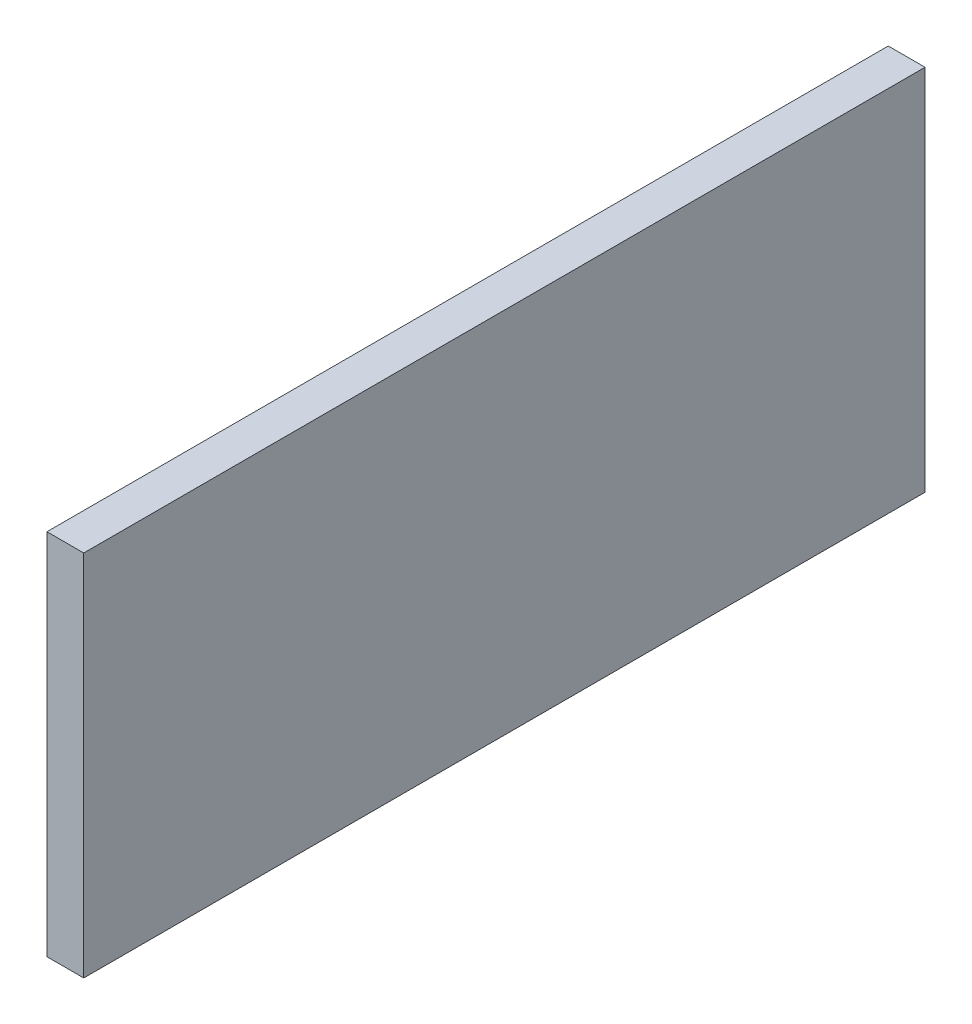
ISO-10303-21;
HEADER;
FILE_DESCRIPTION(('STEP AP214'),'2;1');
FILE_NAME('part.step','',(''),(''),'','','');
FILE_SCHEMA(('AUTOMOTIVE_DESIGN { 1 0 10303 214 1 1 1 1 }'));
ENDSEC;
DATA;
#1=APPLICATION_CONTEXT('core data for automotive mechanical design processes');
#2=APPLICATION_PROTOCOL_DEFINITION('international standard','automotive_design',2000,#1);
#3=PRODUCT_CONTEXT('',#1,'mechanical');
#4=PRODUCT('Part','Part','',(#3));
#5=PRODUCT_RELATED_PRODUCT_CATEGORY('part','',(#4));
#6=PRODUCT_DEFINITION_FORMATION('','',#4);
#7=PRODUCT_DEFINITION_CONTEXT('part definition',#1,'design');
#8=PRODUCT_DEFINITION('design','',#6,#7);
#9=PRODUCT_DEFINITION_SHAPE('','',#8);
#10=(LENGTH_UNIT() NAMED_UNIT(*) SI_UNIT(.MILLI.,.METRE.));
#11=(NAMED_UNIT(*) PLANE_ANGLE_UNIT() SI_UNIT($,.RADIAN.));
#12=(NAMED_UNIT(*) SI_UNIT($,.STERADIAN.) SOLID_ANGLE_UNIT());
#13=UNCERTAINTY_MEASURE_WITH_UNIT(LENGTH_MEASURE(1.E-05),#10,'distance_accuracy_value','');
#14=(GEOMETRIC_REPRESENTATION_CONTEXT(3) GLOBAL_UNCERTAINTY_ASSIGNED_CONTEXT((#13)) GLOBAL_UNIT_ASSIGNED_CONTEXT((#10,
#11,#12)) REPRESENTATION_CONTEXT('',''));
#15=CARTESIAN_POINT('',(0.,0.,0.));
#16=DIRECTION('',(0.,0.,1.));
#17=DIRECTION('',(1.,0.,0.));
#18=AXIS2_PLACEMENT_3D('',#15,#16,#17);
#19=CARTESIAN_POINT('',(7.,35.,-80.));
#20=DIRECTION('',(0.,0.,1.));
#21=DIRECTION('',(0.,-1.,0.));
#22=AXIS2_PLACEMENT_3D('',#19,#20,#21);
#23=PLANE('',#22);
#24=DIRECTION('',(0.,1.,0.));
#25=VECTOR('',#24,1.);
#26=CARTESIAN_POINT('',(0.,35.,-80.));
#27=LINE('',#26,#25);
#28=CARTESIAN_POINT('',(0.,-35.,-80.));
#29=VERTEX_POINT('',#28);
#30=CARTESIAN_POINT('',(0.,35.,-80.));
#31=VERTEX_POINT('',#30);
#32=EDGE_CURVE('E105',#29,#31,#27,.T.);
#33=ORIENTED_EDGE('',*,*,#32,.T.);
#34=DIRECTION('',(-1.,0.,0.));
#35=VECTOR('',#34,1.);
#36=CARTESIAN_POINT('',(7.,35.,-80.));
#37=LINE('',#36,#35);
#38=CARTESIAN_POINT('',(7.,35.,-80.));
#39=VERTEX_POINT('',#38);
#40=EDGE_CURVE('E11',#39,#31,#37,.T.);
#41=ORIENTED_EDGE('',*,*,#40,.F.);
#42=DIRECTION('',(0.,1.,0.));
#43=VECTOR('',#42,1.);
#44=CARTESIAN_POINT('',(7.,35.,-80.));
#45=LINE('',#44,#43);
#46=CARTESIAN_POINT('',(7.,-35.,-80.));
#47=VERTEX_POINT('',#46);
#48=EDGE_CURVE('E89',#47,#39,#45,.T.);
#49=ORIENTED_EDGE('',*,*,#48,.F.);
#50=DIRECTION('',(-1.,0.,0.));
#51=VECTOR('',#50,1.);
#52=CARTESIAN_POINT('',(7.,-35.,-80.));
#53=LINE('',#52,#51);
#54=EDGE_CURVE('E101',#47,#29,#53,.T.);
#55=ORIENTED_EDGE('',*,*,#54,.T.);
#56=EDGE_LOOP('',(#33,#41,#49,#55));
#57=FACE_BOUND('',#56,.T.);
#58=ADVANCED_FACE('F37',(#57),#23,.F.);
#59=CARTESIAN_POINT('',(7.,35.,80.));
#60=DIRECTION('',(0.,-1.,0.));
#61=DIRECTION('',(0.,0.,-1.));
#62=AXIS2_PLACEMENT_3D('',#59,#60,#61);
#63=PLANE('',#62);
#64=DIRECTION('',(0.,0.,1.));
#65=VECTOR('',#64,1.);
#66=CARTESIAN_POINT('',(0.,35.,80.));
#67=LINE('',#66,#65);
#68=CARTESIAN_POINT('',(0.,35.,80.));
#69=VERTEX_POINT('',#68);
#70=EDGE_CURVE('E94',#31,#69,#67,.T.);
#71=ORIENTED_EDGE('',*,*,#70,.T.);
#72=DIRECTION('',(-1.,0.,0.));
#73=VECTOR('',#72,1.);
#74=CARTESIAN_POINT('',(7.,35.,80.));
#75=LINE('',#74,#73);
#76=CARTESIAN_POINT('',(7.,35.,80.));
#77=VERTEX_POINT('',#76);
#78=EDGE_CURVE('E46',#77,#69,#75,.T.);
#79=ORIENTED_EDGE('',*,*,#78,.F.);
#80=DIRECTION('',(0.,0.,1.));
#81=VECTOR('',#80,1.);
#82=CARTESIAN_POINT('',(7.,35.,80.));
#83=LINE('',#82,#81);
#84=EDGE_CURVE('E84',#39,#77,#83,.T.);
#85=ORIENTED_EDGE('',*,*,#84,.F.);
#86=ORIENTED_EDGE('',*,*,#40,.T.);
#87=EDGE_LOOP('',(#71,#79,#85,#86));
#88=FACE_BOUND('',#87,.T.);
#89=ADVANCED_FACE('F93',(#88),#63,.F.);
#90=CARTESIAN_POINT('',(7.,35.,80.));
#91=DIRECTION('',(0.,0.,-1.));
#92=DIRECTION('',(-1.,0.,0.));
#93=AXIS2_PLACEMENT_3D('',#90,#91,#92);
#94=PLANE('',#93);
#95=DIRECTION('',(0.,-1.,0.));
#96=VECTOR('',#95,1.);
#97=CARTESIAN_POINT('',(0.,35.,80.));
#98=LINE('',#97,#96);
#99=CARTESIAN_POINT('',(0.,-35.,80.));
#100=VERTEX_POINT('',#99);
#101=EDGE_CURVE('E71',#69,#100,#98,.T.);
#102=ORIENTED_EDGE('',*,*,#101,.T.);
#103=DIRECTION('',(-1.,0.,0.));
#104=VECTOR('',#103,1.);
#105=CARTESIAN_POINT('',(7.,-35.,80.));
#106=LINE('',#105,#104);
#107=CARTESIAN_POINT('',(7.,-35.,80.));
#108=VERTEX_POINT('',#107);
#109=EDGE_CURVE('E96',#108,#100,#106,.T.);
#110=ORIENTED_EDGE('',*,*,#109,.F.);
#111=DIRECTION('',(0.,-1.,0.));
#112=VECTOR('',#111,1.);
#113=CARTESIAN_POINT('',(7.,35.,80.));
#114=LINE('',#113,#112);
#115=EDGE_CURVE('E87',#77,#108,#114,.T.);
#116=ORIENTED_EDGE('',*,*,#115,.F.);
#117=ORIENTED_EDGE('',*,*,#78,.T.);
#118=EDGE_LOOP('',(#102,#110,#116,#117));
#119=FACE_BOUND('',#118,.T.);
#120=ADVANCED_FACE('F97',(#119),#94,.F.);
#121=CARTESIAN_POINT('',(7.,-35.,80.));
#122=DIRECTION('',(0.,1.,0.));
#123=DIRECTION('',(0.,0.,1.));
#124=AXIS2_PLACEMENT_3D('',#121,#122,#123);
#125=PLANE('',#124);
#126=DIRECTION('',(0.,0.,-1.));
#127=VECTOR('',#126,1.);
#128=CARTESIAN_POINT('',(0.,-35.,80.));
#129=LINE('',#128,#127);
#130=EDGE_CURVE('E77',#100,#29,#129,.T.);
#131=ORIENTED_EDGE('',*,*,#130,.T.);
#132=ORIENTED_EDGE('',*,*,#54,.F.);
#133=DIRECTION('',(0.,0.,-1.));
#134=VECTOR('',#133,1.);
#135=CARTESIAN_POINT('',(7.,-35.,80.));
#136=LINE('',#135,#134);
#137=EDGE_CURVE('E54',#108,#47,#136,.T.);
#138=ORIENTED_EDGE('',*,*,#137,.F.);
#139=ORIENTED_EDGE('',*,*,#109,.T.);
#140=EDGE_LOOP('',(#131,#132,#138,#139));
#141=FACE_BOUND('',#140,.T.);
#142=ADVANCED_FACE('F118',(#141),#125,.F.);
#143=CARTESIAN_POINT('',(7.,0.,0.));
#144=DIRECTION('',(1.,0.,0.));
#145=DIRECTION('',(0.,0.,-1.));
#146=AXIS2_PLACEMENT_3D('',#143,#144,#145);
#147=PLANE('',#146);
#148=ORIENTED_EDGE('',*,*,#48,.T.);
#149=ORIENTED_EDGE('',*,*,#84,.T.);
#150=ORIENTED_EDGE('',*,*,#115,.T.);
#151=ORIENTED_EDGE('',*,*,#137,.T.);
#152=EDGE_LOOP('',(#148,#149,#150,#151));
#153=FACE_BOUND('',#152,.T.);
#154=ADVANCED_FACE('F85',(#153),#147,.T.);
#155=CARTESIAN_POINT('',(0.,0.,0.));
#156=DIRECTION('',(1.,0.,0.));
#157=DIRECTION('',(0.,0.,-1.));
#158=AXIS2_PLACEMENT_3D('',#155,#156,#157);
#159=PLANE('',#158);
#160=ORIENTED_EDGE('',*,*,#32,.F.);
#161=ORIENTED_EDGE('',*,*,#130,.F.);
#162=ORIENTED_EDGE('',*,*,#101,.F.);
#163=ORIENTED_EDGE('',*,*,#70,.F.);
#164=EDGE_LOOP('',(#160,#161,#162,#163));
#165=FACE_BOUND('',#164,.T.);
#166=ADVANCED_FACE('F121',(#165),#159,.F.);
#167=CLOSED_SHELL('',(#58,#89,#120,#142,#154,#166));
#168=MANIFOLD_SOLID_BREP('B2',#167);
#169=ADVANCED_BREP_SHAPE_REPRESENTATION('',(#18,#168),#14);
#170=SHAPE_DEFINITION_REPRESENTATION(#9,#169);
ENDSEC;
END-ISO-10303-21;
